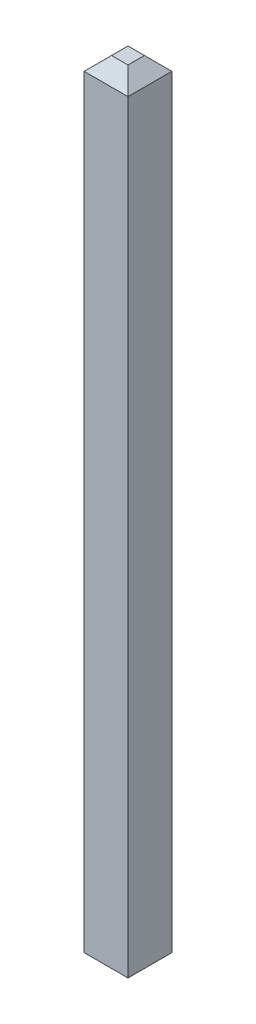
ISO-10303-21;
HEADER;
FILE_DESCRIPTION(('STEP AP214'),'2;1');
FILE_NAME('part.step','',(''),(''),'','','');
FILE_SCHEMA(('AUTOMOTIVE_DESIGN { 1 0 10303 214 1 1 1 1 }'));
ENDSEC;
DATA;
#1=APPLICATION_CONTEXT('core data for automotive mechanical design processes');
#2=APPLICATION_PROTOCOL_DEFINITION('international standard','automotive_design',2000,#1);
#3=PRODUCT_CONTEXT('',#1,'mechanical');
#4=PRODUCT('Part','Part','',(#3));
#5=PRODUCT_RELATED_PRODUCT_CATEGORY('part','',(#4));
#6=PRODUCT_DEFINITION_FORMATION('','',#4);
#7=PRODUCT_DEFINITION_CONTEXT('part definition',#1,'design');
#8=PRODUCT_DEFINITION('design','',#6,#7);
#9=PRODUCT_DEFINITION_SHAPE('','',#8);
#10=(LENGTH_UNIT() NAMED_UNIT(*) SI_UNIT(.MILLI.,.METRE.));
#11=(NAMED_UNIT(*) PLANE_ANGLE_UNIT() SI_UNIT($,.RADIAN.));
#12=(NAMED_UNIT(*) SI_UNIT($,.STERADIAN.) SOLID_ANGLE_UNIT());
#13=UNCERTAINTY_MEASURE_WITH_UNIT(LENGTH_MEASURE(1.E-05),#10,'distance_accuracy_value','');
#14=(GEOMETRIC_REPRESENTATION_CONTEXT(3) GLOBAL_UNCERTAINTY_ASSIGNED_CONTEXT((#13)) GLOBAL_UNIT_ASSIGNED_CONTEXT((#10,
#11,#12)) REPRESENTATION_CONTEXT('',''));
#15=CARTESIAN_POINT('',(0.,0.,0.));
#16=DIRECTION('',(0.,0.,1.));
#17=DIRECTION('',(1.,0.,0.));
#18=AXIS2_PLACEMENT_3D('',#15,#16,#17);
#19=CARTESIAN_POINT('',(-6.03,7.07,-0.32));
#20=DIRECTION('',(-0.707106781186548,-0.707106781186548,0.));
#21=DIRECTION('',(-0.707106781186548,0.707106781186548,0.));
#22=AXIS2_PLACEMENT_3D('',#19,#20,#21);
#23=PLANE('',#22);
#24=DIRECTION('',(0.577350269189626,-0.577350269189626,0.577350269189626));
#25=VECTOR('',#24,1.);
#26=CARTESIAN_POINT('',(-6.243333333333,7.283333333333,0.106666666667));
#27=LINE('',#26,#25);
#28=CARTESIAN_POINT('',(-6.23,7.27,0.12));
#29=VERTEX_POINT('',#28);
#30=CARTESIAN_POINT('',(-6.03,7.07,0.32));
#31=VERTEX_POINT('',#30);
#32=EDGE_CURVE('E95',#29,#31,#27,.T.);
#33=ORIENTED_EDGE('',*,*,#32,.T.);
#34=DIRECTION('',(0.,0.,1.));
#35=VECTOR('',#34,1.);
#36=CARTESIAN_POINT('',(-6.03,7.07,-0.32));
#37=LINE('',#36,#35);
#38=CARTESIAN_POINT('',(-6.03,7.07,-0.32));
#39=VERTEX_POINT('',#38);
#40=EDGE_CURVE('E116',#39,#31,#37,.T.);
#41=ORIENTED_EDGE('',*,*,#40,.F.);
#42=DIRECTION('',(0.577350269189626,-0.577350269189626,-0.577350269189626));
#43=VECTOR('',#42,1.);
#44=CARTESIAN_POINT('',(-6.03,7.07,-0.32));
#45=LINE('',#44,#43);
#46=CARTESIAN_POINT('',(-6.23,7.27,-0.12));
#47=VERTEX_POINT('',#46);
#48=EDGE_CURVE('E11',#47,#39,#45,.T.);
#49=ORIENTED_EDGE('',*,*,#48,.F.);
#50=DIRECTION('',(0.,0.,-1.));
#51=VECTOR('',#50,1.);
#52=CARTESIAN_POINT('',(-6.23,7.27,-0.32));
#53=LINE('',#52,#51);
#54=EDGE_CURVE('E110',#29,#47,#53,.T.);
#55=ORIENTED_EDGE('',*,*,#54,.F.);
#56=EDGE_LOOP('',(#33,#41,#49,#55));
#57=FACE_BOUND('',#56,.T.);
#58=ADVANCED_FACE('F17',(#57),#23,.F.);
#59=CARTESIAN_POINT('',(-6.35,7.07,-0.32));
#60=DIRECTION('',(0.,0.707106781186548,-0.707106781186548));
#61=DIRECTION('',(-1.,0.,0.));
#62=AXIS2_PLACEMENT_3D('',#59,#60,#61);
#63=PLANE('',#62);
#64=DIRECTION('',(0.577350269189626,0.577350269189626,0.577350269189626));
#65=VECTOR('',#64,1.);
#66=CARTESIAN_POINT('',(-6.536666666667,7.203333333333,-0.186666666667));
#67=LINE('',#66,#65);
#68=CARTESIAN_POINT('',(-6.67,7.07,-0.32));
#69=VERTEX_POINT('',#68);
#70=CARTESIAN_POINT('',(-6.47,7.27,-0.12));
#71=VERTEX_POINT('',#70);
#72=EDGE_CURVE('E26',#69,#71,#67,.T.);
#73=ORIENTED_EDGE('',*,*,#72,.T.);
#74=DIRECTION('',(-1.,0.,0.));
#75=VECTOR('',#74,1.);
#76=CARTESIAN_POINT('',(-6.67,7.27,-0.12));
#77=LINE('',#76,#75);
#78=EDGE_CURVE('E115',#47,#71,#77,.T.);
#79=ORIENTED_EDGE('',*,*,#78,.F.);
#80=ORIENTED_EDGE('',*,*,#48,.T.);
#81=DIRECTION('',(1.,0.,0.));
#82=VECTOR('',#81,1.);
#83=CARTESIAN_POINT('',(-6.03,7.07,-0.32));
#84=LINE('',#83,#82);
#85=EDGE_CURVE('E137',#69,#39,#84,.T.);
#86=ORIENTED_EDGE('',*,*,#85,.F.);
#87=EDGE_LOOP('',(#73,#79,#80,#86));
#88=FACE_BOUND('',#87,.T.);
#89=ADVANCED_FACE('F135',(#88),#63,.T.);
#90=CARTESIAN_POINT('',(-6.47,7.27,-0.32));
#91=DIRECTION('',(0.707106781186548,-0.707106781186548,0.));
#92=DIRECTION('',(0.,0.,-1.));
#93=AXIS2_PLACEMENT_3D('',#90,#91,#92);
#94=PLANE('',#93);
#95=DIRECTION('',(-0.577350269189626,-0.577350269189626,0.577350269189626));
#96=VECTOR('',#95,1.);
#97=CARTESIAN_POINT('',(-6.536666666667,7.203333333333,0.186666666667));
#98=LINE('',#97,#96);
#99=CARTESIAN_POINT('',(-6.47,7.27,0.12));
#100=VERTEX_POINT('',#99);
#101=CARTESIAN_POINT('',(-6.67,7.07,0.32));
#102=VERTEX_POINT('',#101);
#103=EDGE_CURVE('E39',#100,#102,#98,.T.);
#104=ORIENTED_EDGE('',*,*,#103,.F.);
#105=DIRECTION('',(0.,0.,1.));
#106=VECTOR('',#105,1.);
#107=CARTESIAN_POINT('',(-6.47,7.27,-0.32));
#108=LINE('',#107,#106);
#109=EDGE_CURVE('E111',#71,#100,#108,.T.);
#110=ORIENTED_EDGE('',*,*,#109,.F.);
#111=ORIENTED_EDGE('',*,*,#72,.F.);
#112=DIRECTION('',(0.,0.,-1.));
#113=VECTOR('',#112,1.);
#114=CARTESIAN_POINT('',(-6.67,7.07,-0.32));
#115=LINE('',#114,#113);
#116=EDGE_CURVE('E348',#102,#69,#115,.T.);
#117=ORIENTED_EDGE('',*,*,#116,.F.);
#118=EDGE_LOOP('',(#104,#110,#111,#117));
#119=FACE_BOUND('',#118,.T.);
#120=ADVANCED_FACE('F140',(#119),#94,.F.);
#121=CARTESIAN_POINT('',(-6.67,7.27,0.12));
#122=DIRECTION('',(0.,-0.707106781186548,-0.707106781186548));
#123=DIRECTION('',(0.,-0.707106781186548,0.707106781186548));
#124=AXIS2_PLACEMENT_3D('',#121,#122,#123);
#125=PLANE('',#124);
#126=ORIENTED_EDGE('',*,*,#32,.F.);
#127=DIRECTION('',(1.,0.,0.));
#128=VECTOR('',#127,1.);
#129=CARTESIAN_POINT('',(-6.67,7.27,0.12));
#130=LINE('',#129,#128);
#131=EDGE_CURVE('E98',#100,#29,#130,.T.);
#132=ORIENTED_EDGE('',*,*,#131,.F.);
#133=ORIENTED_EDGE('',*,*,#103,.T.);
#134=DIRECTION('',(-1.,0.,0.));
#135=VECTOR('',#134,1.);
#136=CARTESIAN_POINT('',(-6.35,7.07,0.32));
#137=LINE('',#136,#135);
#138=EDGE_CURVE('E101',#31,#102,#137,.T.);
#139=ORIENTED_EDGE('',*,*,#138,.F.);
#140=EDGE_LOOP('',(#126,#132,#133,#139));
#141=FACE_BOUND('',#140,.T.);
#142=ADVANCED_FACE('F97',(#141),#125,.F.);
#143=CARTESIAN_POINT('',(-6.67,7.27,-0.32));
#144=DIRECTION('',(0.,-1.,0.));
#145=DIRECTION('',(0.,0.,-1.));
#146=AXIS2_PLACEMENT_3D('',#143,#144,#145);
#147=PLANE('',#146);
#148=ORIENTED_EDGE('',*,*,#54,.T.);
#149=ORIENTED_EDGE('',*,*,#78,.T.);
#150=ORIENTED_EDGE('',*,*,#109,.T.);
#151=ORIENTED_EDGE('',*,*,#131,.T.);
#152=EDGE_LOOP('',(#148,#149,#150,#151));
#153=FACE_BOUND('',#152,.T.);
#154=ADVANCED_FACE('F108',(#153),#147,.F.);
#155=CARTESIAN_POINT('',(-6.03,7.27,-0.32));
#156=DIRECTION('',(-1.,0.,0.));
#157=DIRECTION('',(0.,1.,0.));
#158=AXIS2_PLACEMENT_3D('',#155,#156,#157);
#159=PLANE('',#158);
#160=DIRECTION('',(0.,-1.,0.));
#161=VECTOR('',#160,1.);
#162=CARTESIAN_POINT('',(-6.03,7.27,-0.32));
#163=LINE('',#162,#161);
#164=CARTESIAN_POINT('',(-6.03,-4.07,-0.32));
#165=VERTEX_POINT('',#164);
#166=EDGE_CURVE('E353',#39,#165,#163,.T.);
#167=ORIENTED_EDGE('',*,*,#166,.F.);
#168=ORIENTED_EDGE('',*,*,#40,.T.);
#169=DIRECTION('',(0.,-1.,0.));
#170=VECTOR('',#169,1.);
#171=CARTESIAN_POINT('',(-6.03,7.27,0.32));
#172=LINE('',#171,#170);
#173=CARTESIAN_POINT('',(-6.03,-4.07,0.32));
#174=VERTEX_POINT('',#173);
#175=EDGE_CURVE('E125',#31,#174,#172,.T.);
#176=ORIENTED_EDGE('',*,*,#175,.T.);
#177=DIRECTION('',(0.,0.,-1.));
#178=VECTOR('',#177,1.);
#179=CARTESIAN_POINT('',(-6.03,-4.07,-0.32));
#180=LINE('',#179,#178);
#181=EDGE_CURVE('E326',#174,#165,#180,.T.);
#182=ORIENTED_EDGE('',*,*,#181,.T.);
#183=EDGE_LOOP('',(#167,#168,#176,#182));
#184=FACE_BOUND('',#183,.T.);
#185=ADVANCED_FACE('F188',(#184),#159,.F.);
#186=CARTESIAN_POINT('',(-6.35,1.5,0.32));
#187=DIRECTION('',(0.,0.,-1.));
#188=DIRECTION('',(0.,-1.,0.));
#189=AXIS2_PLACEMENT_3D('',#186,#187,#188);
#190=PLANE('',#189);
#191=ORIENTED_EDGE('',*,*,#175,.F.);
#192=ORIENTED_EDGE('',*,*,#138,.T.);
#193=DIRECTION('',(0.,1.,0.));
#194=VECTOR('',#193,1.);
#195=CARTESIAN_POINT('',(-6.67,-4.27,0.32));
#196=LINE('',#195,#194);
#197=CARTESIAN_POINT('',(-6.67,-4.07,0.32));
#198=VERTEX_POINT('',#197);
#199=EDGE_CURVE('E351',#198,#102,#196,.T.);
#200=ORIENTED_EDGE('',*,*,#199,.F.);
#201=DIRECTION('',(1.,0.,0.));
#202=VECTOR('',#201,1.);
#203=CARTESIAN_POINT('',(-6.35,-4.07,0.32));
#204=LINE('',#203,#202);
#205=EDGE_CURVE('E329',#198,#174,#204,.T.);
#206=ORIENTED_EDGE('',*,*,#205,.T.);
#207=EDGE_LOOP('',(#191,#192,#200,#206));
#208=FACE_BOUND('',#207,.T.);
#209=ADVANCED_FACE('F198',(#208),#190,.F.);
#210=CARTESIAN_POINT('',(-6.23,-4.27,-0.32));
#211=DIRECTION('',(-0.707106781186548,0.707106781186548,0.));
#212=DIRECTION('',(0.,0.,1.));
#213=AXIS2_PLACEMENT_3D('',#210,#211,#212);
#214=PLANE('',#213);
#215=DIRECTION('',(-0.577350269189626,-0.577350269189626,0.577350269189626));
#216=VECTOR('',#215,1.);
#217=CARTESIAN_POINT('',(-6.163333333333,-4.203333333333,-0.186666666667));
#218=LINE('',#217,#216);
#219=CARTESIAN_POINT('',(-6.23,-4.27,-0.12));
#220=VERTEX_POINT('',#219);
#221=EDGE_CURVE('E372',#165,#220,#218,.T.);
#222=ORIENTED_EDGE('',*,*,#221,.F.);
#223=ORIENTED_EDGE('',*,*,#181,.F.);
#224=DIRECTION('',(-0.577350269189626,-0.577350269189626,-0.577350269189626));
#225=VECTOR('',#224,1.);
#226=CARTESIAN_POINT('',(-6.376666666667,-4.416666666667,-0.02666666666667));
#227=LINE('',#226,#225);
#228=CARTESIAN_POINT('',(-6.23,-4.27,0.12));
#229=VERTEX_POINT('',#228);
#230=EDGE_CURVE('E321',#174,#229,#227,.T.);
#231=ORIENTED_EDGE('',*,*,#230,.T.);
#232=DIRECTION('',(0.,0.,1.));
#233=VECTOR('',#232,1.);
#234=CARTESIAN_POINT('',(-6.23,-4.27,-0.32));
#235=LINE('',#234,#233);
#236=EDGE_CURVE('E325',#220,#229,#235,.T.);
#237=ORIENTED_EDGE('',*,*,#236,.F.);
#238=EDGE_LOOP('',(#222,#223,#231,#237));
#239=FACE_BOUND('',#238,.T.);
#240=ADVANCED_FACE('F208',(#239),#214,.F.);
#241=CARTESIAN_POINT('',(-6.03,-4.27,0.12));
#242=DIRECTION('',(0.,0.707106781186548,-0.707106781186548));
#243=DIRECTION('',(-1.,0.,0.));
#244=AXIS2_PLACEMENT_3D('',#241,#242,#243);
#245=PLANE('',#244);
#246=ORIENTED_EDGE('',*,*,#230,.F.);
#247=ORIENTED_EDGE('',*,*,#205,.F.);
#248=DIRECTION('',(-0.577350269189626,0.577350269189626,0.577350269189626));
#249=VECTOR('',#248,1.);
#250=CARTESIAN_POINT('',(-6.456666666667,-4.283333333333,0.106666666667));
#251=LINE('',#250,#249);
#252=CARTESIAN_POINT('',(-6.47,-4.27,0.12));
#253=VERTEX_POINT('',#252);
#254=EDGE_CURVE('E330',#253,#198,#251,.T.);
#255=ORIENTED_EDGE('',*,*,#254,.F.);
#256=DIRECTION('',(-1.,0.,0.));
#257=VECTOR('',#256,1.);
#258=CARTESIAN_POINT('',(-6.03,-4.27,0.12));
#259=LINE('',#258,#257);
#260=EDGE_CURVE('E333',#229,#253,#259,.T.);
#261=ORIENTED_EDGE('',*,*,#260,.F.);
#262=EDGE_LOOP('',(#246,#247,#255,#261));
#263=FACE_BOUND('',#262,.T.);
#264=ADVANCED_FACE('F218',(#263),#245,.F.);
#265=CARTESIAN_POINT('',(-6.67,-4.07,-0.32));
#266=DIRECTION('',(0.707106781186548,0.707106781186548,0.));
#267=DIRECTION('',(0.,0.,-1.));
#268=AXIS2_PLACEMENT_3D('',#265,#266,#267);
#269=PLANE('',#268);
#270=DIRECTION('',(0.577350269189626,-0.577350269189626,0.577350269189626));
#271=VECTOR('',#270,1.);
#272=CARTESIAN_POINT('',(-6.563333333333,-4.176666666667,-0.213333333333));
#273=LINE('',#272,#271);
#274=CARTESIAN_POINT('',(-6.67,-4.07,-0.32));
#275=VERTEX_POINT('',#274);
#276=CARTESIAN_POINT('',(-6.47,-4.27,-0.12));
#277=VERTEX_POINT('',#276);
#278=EDGE_CURVE('E360',#275,#277,#273,.T.);
#279=ORIENTED_EDGE('',*,*,#278,.T.);
#280=DIRECTION('',(0.,0.,-1.));
#281=VECTOR('',#280,1.);
#282=CARTESIAN_POINT('',(-6.47,-4.27,-0.32));
#283=LINE('',#282,#281);
#284=EDGE_CURVE('E338',#253,#277,#283,.T.);
#285=ORIENTED_EDGE('',*,*,#284,.F.);
#286=ORIENTED_EDGE('',*,*,#254,.T.);
#287=DIRECTION('',(0.,0.,1.));
#288=VECTOR('',#287,1.);
#289=CARTESIAN_POINT('',(-6.67,-4.07,-0.32));
#290=LINE('',#289,#288);
#291=EDGE_CURVE('E350',#275,#198,#290,.T.);
#292=ORIENTED_EDGE('',*,*,#291,.F.);
#293=EDGE_LOOP('',(#279,#285,#286,#292));
#294=FACE_BOUND('',#293,.T.);
#295=ADVANCED_FACE('F228',(#294),#269,.F.);
#296=CARTESIAN_POINT('',(-6.67,-4.27,-0.32));
#297=DIRECTION('',(1.,0.,0.));
#298=DIRECTION('',(0.,0.,1.));
#299=AXIS2_PLACEMENT_3D('',#296,#297,#298);
#300=PLANE('',#299);
#301=ORIENTED_EDGE('',*,*,#199,.T.);
#302=ORIENTED_EDGE('',*,*,#116,.T.);
#303=DIRECTION('',(0.,1.,0.));
#304=VECTOR('',#303,1.);
#305=CARTESIAN_POINT('',(-6.67,-4.27,-0.32));
#306=LINE('',#305,#304);
#307=EDGE_CURVE('E354',#275,#69,#306,.T.);
#308=ORIENTED_EDGE('',*,*,#307,.F.);
#309=ORIENTED_EDGE('',*,*,#291,.T.);
#310=EDGE_LOOP('',(#301,#302,#308,#309));
#311=FACE_BOUND('',#310,.T.);
#312=ADVANCED_FACE('F239',(#311),#300,.F.);
#313=CARTESIAN_POINT('',(-6.35,1.5,-0.32));
#314=DIRECTION('',(0.,0.,-1.));
#315=DIRECTION('',(0.,-1.,0.));
#316=AXIS2_PLACEMENT_3D('',#313,#314,#315);
#317=PLANE('',#316);
#318=ORIENTED_EDGE('',*,*,#307,.T.);
#319=ORIENTED_EDGE('',*,*,#85,.T.);
#320=ORIENTED_EDGE('',*,*,#166,.T.);
#321=DIRECTION('',(-1.,0.,0.));
#322=VECTOR('',#321,1.);
#323=CARTESIAN_POINT('',(-6.67,-4.07,-0.32));
#324=LINE('',#323,#322);
#325=EDGE_CURVE('E366',#165,#275,#324,.T.);
#326=ORIENTED_EDGE('',*,*,#325,.T.);
#327=EDGE_LOOP('',(#318,#319,#320,#326));
#328=FACE_BOUND('',#327,.T.);
#329=ADVANCED_FACE('F250',(#328),#317,.T.);
#330=CARTESIAN_POINT('',(-6.35,-4.07,-0.32));
#331=DIRECTION('',(0.,-0.707106781186548,-0.707106781186548));
#332=DIRECTION('',(0.,-0.707106781186548,0.707106781186548));
#333=AXIS2_PLACEMENT_3D('',#330,#331,#332);
#334=PLANE('',#333);
#335=ORIENTED_EDGE('',*,*,#278,.F.);
#336=ORIENTED_EDGE('',*,*,#325,.F.);
#337=ORIENTED_EDGE('',*,*,#221,.T.);
#338=DIRECTION('',(1.,0.,0.));
#339=VECTOR('',#338,1.);
#340=CARTESIAN_POINT('',(-6.03,-4.27,-0.12));
#341=LINE('',#340,#339);
#342=EDGE_CURVE('E342',#277,#220,#341,.T.);
#343=ORIENTED_EDGE('',*,*,#342,.F.);
#344=EDGE_LOOP('',(#335,#336,#337,#343));
#345=FACE_BOUND('',#344,.T.);
#346=ADVANCED_FACE('F261',(#345),#334,.T.);
#347=CARTESIAN_POINT('',(-6.03,-4.27,-0.32));
#348=DIRECTION('',(0.,1.,0.));
#349=DIRECTION('',(0.,0.,-1.));
#350=AXIS2_PLACEMENT_3D('',#347,#348,#349);
#351=PLANE('',#350);
#352=ORIENTED_EDGE('',*,*,#236,.T.);
#353=ORIENTED_EDGE('',*,*,#260,.T.);
#354=ORIENTED_EDGE('',*,*,#284,.T.);
#355=ORIENTED_EDGE('',*,*,#342,.T.);
#356=EDGE_LOOP('',(#352,#353,#354,#355));
#357=FACE_BOUND('',#356,.T.);
#358=ADVANCED_FACE('F272',(#357),#351,.F.);
#359=CLOSED_SHELL('',(#58,#89,#120,#142,#154,#185,#209,#240,#264,#295,#312,#329,#346,#358));
#360=MANIFOLD_SOLID_BREP('B1',#359);
#361=ADVANCED_BREP_SHAPE_REPRESENTATION('',(#18,#360),#14);
#362=SHAPE_DEFINITION_REPRESENTATION(#9,#361);
ENDSEC;
END-ISO-10303-21;
